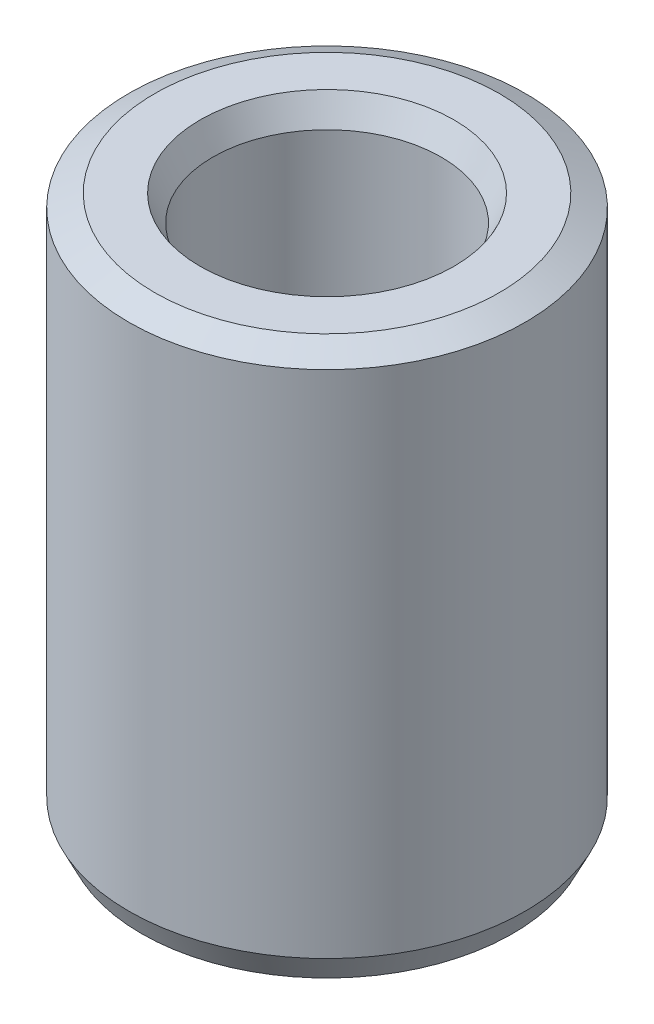
ISO-10303-21;
HEADER;
FILE_DESCRIPTION(('STEP AP214'),'2;1');
FILE_NAME('part.step','',(''),(''),'','','');
FILE_SCHEMA(('AUTOMOTIVE_DESIGN { 1 0 10303 214 1 1 1 1 }'));
ENDSEC;
DATA;
#1=APPLICATION_CONTEXT('core data for automotive mechanical design processes');
#2=APPLICATION_PROTOCOL_DEFINITION('international standard','automotive_design',2000,#1);
#3=PRODUCT_CONTEXT('',#1,'mechanical');
#4=PRODUCT('Part','Part','',(#3));
#5=PRODUCT_RELATED_PRODUCT_CATEGORY('part','',(#4));
#6=PRODUCT_DEFINITION_FORMATION('','',#4);
#7=PRODUCT_DEFINITION_CONTEXT('part definition',#1,'design');
#8=PRODUCT_DEFINITION('design','',#6,#7);
#9=PRODUCT_DEFINITION_SHAPE('','',#8);
#10=(LENGTH_UNIT() NAMED_UNIT(*) SI_UNIT(.MILLI.,.METRE.));
#11=(NAMED_UNIT(*) PLANE_ANGLE_UNIT() SI_UNIT($,.RADIAN.));
#12=(NAMED_UNIT(*) SI_UNIT($,.STERADIAN.) SOLID_ANGLE_UNIT());
#13=UNCERTAINTY_MEASURE_WITH_UNIT(LENGTH_MEASURE(1.E-05),#10,'distance_accuracy_value','');
#14=(GEOMETRIC_REPRESENTATION_CONTEXT(3) GLOBAL_UNCERTAINTY_ASSIGNED_CONTEXT((#13)) GLOBAL_UNIT_ASSIGNED_CONTEXT((#10,
#11,#12)) REPRESENTATION_CONTEXT('',''));
#15=CARTESIAN_POINT('',(0.,0.,0.));
#16=DIRECTION('',(0.,0.,1.));
#17=DIRECTION('',(1.,0.,0.));
#18=AXIS2_PLACEMENT_3D('',#15,#16,#17);
#19=CARTESIAN_POINT('',(0.,159.112025130233,0.));
#20=DIRECTION('',(0.,-1.,0.));
#21=DIRECTION('',(0.,0.,-1.));
#22=AXIS2_PLACEMENT_3D('',#19,#20,#21);
#23=CYLINDRICAL_SURFACE('',#22,57.5);
#24=CARTESIAN_POINT('',(0.,7.49794524835881,0.));
#25=DIRECTION('',(0.,1.,0.));
#26=DIRECTION('',(0.,0.,1.));
#27=AXIS2_PLACEMENT_3D('',#24,#25,#26);
#28=CIRCLE('',#27,57.5);
#29=CARTESIAN_POINT('',(0.,7.49794524835881,57.5));
#30=VERTEX_POINT('',#29);
#31=EDGE_CURVE('E10',#30,#30,#28,.T.);
#32=ORIENTED_EDGE('',*,*,#31,.T.);
#33=EDGE_LOOP('',(#32));
#34=FACE_BOUND('',#33,.T.);
#35=CARTESIAN_POINT('',(0.,155.418782215822,0.));
#36=DIRECTION('',(0.,1.,0.));
#37=DIRECTION('',(0.,0.,1.));
#38=AXIS2_PLACEMENT_3D('',#35,#36,#37);
#39=CIRCLE('',#38,57.5);
#40=CARTESIAN_POINT('',(0.,155.418782215822,57.5));
#41=VERTEX_POINT('',#40);
#42=EDGE_CURVE('E50',#41,#41,#39,.F.);
#43=ORIENTED_EDGE('',*,*,#42,.T.);
#44=EDGE_LOOP('',(#43));
#45=FACE_BOUND('',#44,.T.);
#46=ADVANCED_FACE('F39',(#34,#45),#23,.T.);
#47=CARTESIAN_POINT('',(0.,159.112025130233,0.));
#48=DIRECTION('',(0.,1.,0.));
#49=DIRECTION('',(0.,0.,1.));
#50=AXIS2_PLACEMENT_3D('',#47,#48,#49);
#51=PLANE('',#50);
#52=CARTESIAN_POINT('',(0.,159.112025130233,0.));
#53=DIRECTION('',(0.,1.,0.));
#54=DIRECTION('',(0.,0.,1.));
#55=AXIS2_PLACEMENT_3D('',#52,#53,#54);
#56=CIRCLE('',#55,36.8102828851881);
#57=CARTESIAN_POINT('',(0.,159.112025130233,36.8102828851881));
#58=VERTEX_POINT('',#57);
#59=EDGE_CURVE('E58',#58,#58,#56,.F.);
#60=ORIENTED_EDGE('',*,*,#59,.T.);
#61=EDGE_LOOP('',(#60));
#62=FACE_BOUND('',#61,.T.);
#63=CARTESIAN_POINT('',(0.,159.112025130233,0.));
#64=DIRECTION('',(0.,1.,0.));
#65=DIRECTION('',(0.,0.,1.));
#66=AXIS2_PLACEMENT_3D('',#63,#64,#65);
#67=CIRCLE('',#66,50.0020547516412);
#68=CARTESIAN_POINT('',(0.,159.112025130233,50.0020547516412));
#69=VERTEX_POINT('',#68);
#70=EDGE_CURVE('E61',#69,#69,#67,.T.);
#71=ORIENTED_EDGE('',*,*,#70,.T.);
#72=EDGE_LOOP('',(#71));
#73=FACE_BOUND('',#72,.T.);
#74=ADVANCED_FACE('F88',(#62,#73),#51,.T.);
#75=CARTESIAN_POINT('',(0.,0.,0.));
#76=DIRECTION('',(0.,1.,0.));
#77=DIRECTION('',(0.,0.,1.));
#78=AXIS2_PLACEMENT_3D('',#75,#76,#77);
#79=PLANE('',#78);
#80=CARTESIAN_POINT('',(0.,0.,0.));
#81=DIRECTION('',(0.,1.,0.));
#82=DIRECTION('',(0.,0.,1.));
#83=AXIS2_PLACEMENT_3D('',#80,#81,#82);
#84=CIRCLE('',#83,40.6149852191363);
#85=CARTESIAN_POINT('',(0.,0.,40.6149852191363));
#86=VERTEX_POINT('',#85);
#87=EDGE_CURVE('E51',#86,#86,#84,.T.);
#88=ORIENTED_EDGE('',*,*,#87,.T.);
#89=EDGE_LOOP('',(#88));
#90=FACE_BOUND('',#89,.T.);
#91=CARTESIAN_POINT('',(0.,0.,0.));
#92=DIRECTION('',(0.,1.,0.));
#93=DIRECTION('',(0.,0.,1.));
#94=AXIS2_PLACEMENT_3D('',#91,#92,#93);
#95=CIRCLE('',#94,53.8067570855894);
#96=CARTESIAN_POINT('',(0.,0.,53.8067570855894));
#97=VERTEX_POINT('',#96);
#98=EDGE_CURVE('E54',#97,#97,#95,.F.);
#99=ORIENTED_EDGE('',*,*,#98,.T.);
#100=EDGE_LOOP('',(#99));
#101=FACE_BOUND('',#100,.T.);
#102=ADVANCED_FACE('F83',(#90,#101),#79,.F.);
#103=CARTESIAN_POINT('',(0.,159.112025130233,0.));
#104=DIRECTION('',(0.,-1.,0.));
#105=DIRECTION('',(0.,0.,-1.));
#106=AXIS2_PLACEMENT_3D('',#103,#104,#105);
#107=CYLINDRICAL_SURFACE('',#106,33.1170399707775);
#108=CARTESIAN_POINT('',(0.,151.614079881874,0.));
#109=DIRECTION('',(0.,1.,0.));
#110=DIRECTION('',(0.,0.,1.));
#111=AXIS2_PLACEMENT_3D('',#108,#109,#110);
#112=CIRCLE('',#111,33.1170399707775);
#113=CARTESIAN_POINT('',(0.,151.614079881874,33.1170399707775));
#114=VERTEX_POINT('',#113);
#115=EDGE_CURVE('E67',#114,#114,#112,.T.);
#116=ORIENTED_EDGE('',*,*,#115,.T.);
#117=EDGE_LOOP('',(#116));
#118=FACE_BOUND('',#117,.T.);
#119=CARTESIAN_POINT('',(0.,3.69324291441056,0.));
#120=DIRECTION('',(0.,1.,0.));
#121=DIRECTION('',(0.,0.,1.));
#122=AXIS2_PLACEMENT_3D('',#119,#120,#121);
#123=CIRCLE('',#122,33.1170399707775);
#124=CARTESIAN_POINT('',(0.,3.69324291441056,33.1170399707775));
#125=VERTEX_POINT('',#124);
#126=EDGE_CURVE('E69',#125,#125,#123,.F.);
#127=ORIENTED_EDGE('',*,*,#126,.T.);
#128=EDGE_LOOP('',(#127));
#129=FACE_BOUND('',#128,.T.);
#130=ADVANCED_FACE('F71',(#118,#129),#107,.F.);
#131=CARTESIAN_POINT('',(0.,151.614079881874,0.));
#132=DIRECTION('',(0.,1.,0.));
#133=DIRECTION('',(0.,0.,1.));
#134=AXIS2_PLACEMENT_3D('',#131,#132,#133);
#135=CONICAL_SURFACE('',#134,33.1170399707775,0.457683817332996);
#136=ORIENTED_EDGE('',*,*,#59,.F.);
#137=EDGE_LOOP('',(#136));
#138=FACE_BOUND('',#137,.T.);
#139=ORIENTED_EDGE('',*,*,#115,.F.);
#140=EDGE_LOOP('',(#139));
#141=FACE_BOUND('',#140,.T.);
#142=ADVANCED_FACE('F77',(#138,#141),#135,.F.);
#143=CARTESIAN_POINT('',(0.,0.,0.));
#144=DIRECTION('',(0.,-1.,0.));
#145=DIRECTION('',(0.,0.,-1.));
#146=AXIS2_PLACEMENT_3D('',#143,#144,#145);
#147=CONICAL_SURFACE('',#146,40.6149852191363,1.1131125094619);
#148=ORIENTED_EDGE('',*,*,#126,.F.);
#149=EDGE_LOOP('',(#148));
#150=FACE_BOUND('',#149,.T.);
#151=ORIENTED_EDGE('',*,*,#87,.F.);
#152=EDGE_LOOP('',(#151));
#153=FACE_BOUND('',#152,.T.);
#154=ADVANCED_FACE('F73',(#150,#153),#147,.F.);
#155=CARTESIAN_POINT('',(0.,7.49794524835881,0.));
#156=DIRECTION('',(0.,1.,0.));
#157=DIRECTION('',(0.,0.,1.));
#158=AXIS2_PLACEMENT_3D('',#155,#156,#157);
#159=CONICAL_SURFACE('',#158,57.5,0.457683817332997);
#160=ORIENTED_EDGE('',*,*,#98,.F.);
#161=EDGE_LOOP('',(#160));
#162=FACE_BOUND('',#161,.T.);
#163=ORIENTED_EDGE('',*,*,#31,.F.);
#164=EDGE_LOOP('',(#163));
#165=FACE_BOUND('',#164,.T.);
#166=ADVANCED_FACE('F76',(#162,#165),#159,.T.);
#167=CARTESIAN_POINT('',(0.,159.112025130233,0.));
#168=DIRECTION('',(0.,-1.,0.));
#169=DIRECTION('',(0.,0.,-1.));
#170=AXIS2_PLACEMENT_3D('',#167,#168,#169);
#171=CONICAL_SURFACE('',#170,50.0020547516412,1.1131125094619);
#172=ORIENTED_EDGE('',*,*,#42,.F.);
#173=EDGE_LOOP('',(#172));
#174=FACE_BOUND('',#173,.T.);
#175=ORIENTED_EDGE('',*,*,#70,.F.);
#176=EDGE_LOOP('',(#175));
#177=FACE_BOUND('',#176,.T.);
#178=ADVANCED_FACE('F45',(#174,#177),#171,.T.);
#179=CLOSED_SHELL('',(#46,#74,#102,#130,#142,#154,#166,#178));
#180=MANIFOLD_SOLID_BREP('B2',#179);
#181=ADVANCED_BREP_SHAPE_REPRESENTATION('',(#18,#180),#14);
#182=SHAPE_DEFINITION_REPRESENTATION(#9,#181);
ENDSEC;
END-ISO-10303-21;
